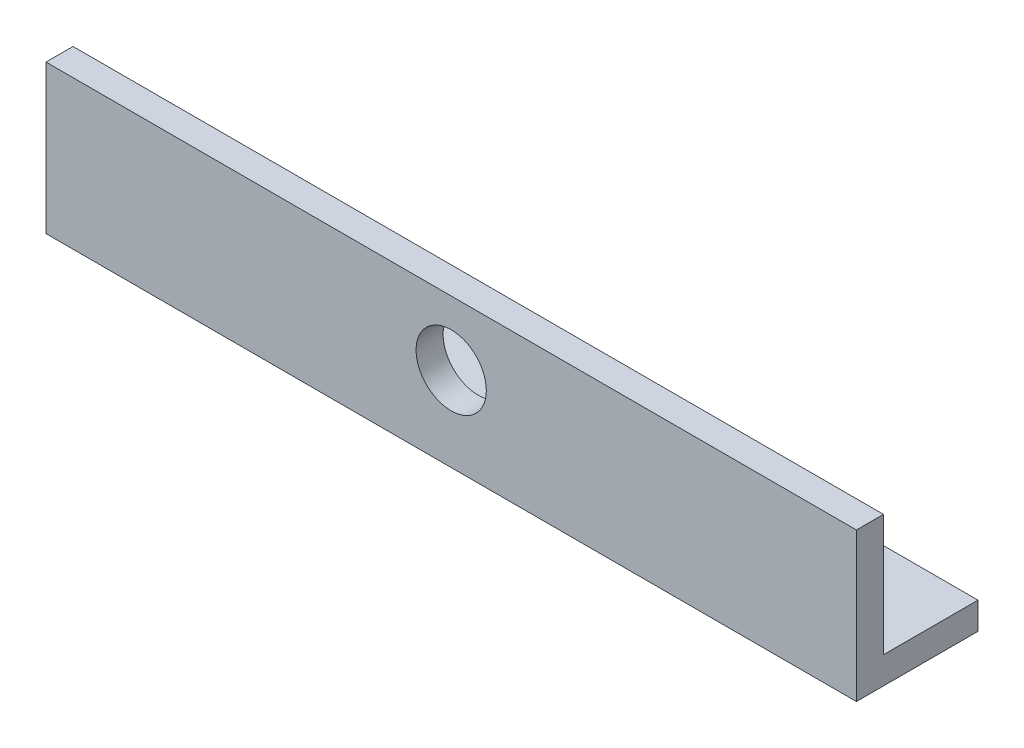
ISO-10303-21;
HEADER;
FILE_DESCRIPTION(('STEP AP214'),'2;1');
FILE_NAME('part.step','',(''),(''),'','','');
FILE_SCHEMA(('AUTOMOTIVE_DESIGN { 1 0 10303 214 1 1 1 1 }'));
ENDSEC;
DATA;
#1=APPLICATION_CONTEXT('core data for automotive mechanical design processes');
#2=APPLICATION_PROTOCOL_DEFINITION('international standard','automotive_design',2000,#1);
#3=PRODUCT_CONTEXT('',#1,'mechanical');
#4=PRODUCT('Part','Part','',(#3));
#5=PRODUCT_RELATED_PRODUCT_CATEGORY('part','',(#4));
#6=PRODUCT_DEFINITION_FORMATION('','',#4);
#7=PRODUCT_DEFINITION_CONTEXT('part definition',#1,'design');
#8=PRODUCT_DEFINITION('design','',#6,#7);
#9=PRODUCT_DEFINITION_SHAPE('','',#8);
#10=(LENGTH_UNIT() NAMED_UNIT(*) SI_UNIT(.MILLI.,.METRE.));
#11=(NAMED_UNIT(*) PLANE_ANGLE_UNIT() SI_UNIT($,.RADIAN.));
#12=(NAMED_UNIT(*) SI_UNIT($,.STERADIAN.) SOLID_ANGLE_UNIT());
#13=UNCERTAINTY_MEASURE_WITH_UNIT(LENGTH_MEASURE(1.E-05),#10,'distance_accuracy_value','');
#14=(GEOMETRIC_REPRESENTATION_CONTEXT(3) GLOBAL_UNCERTAINTY_ASSIGNED_CONTEXT((#13)) GLOBAL_UNIT_ASSIGNED_CONTEXT((#10,
#11,#12)) REPRESENTATION_CONTEXT('',''));
#15=CARTESIAN_POINT('',(0.,0.,0.));
#16=DIRECTION('',(0.,0.,1.));
#17=DIRECTION('',(1.,0.,0.));
#18=AXIS2_PLACEMENT_3D('',#15,#16,#17);
#19=CARTESIAN_POINT('',(150.,-31.1904761904762,0.));
#20=DIRECTION('',(0.,1.,0.));
#21=DIRECTION('',(0.,0.,1.));
#22=AXIS2_PLACEMENT_3D('',#19,#20,#21);
#23=PLANE('',#22);
#24=DIRECTION('',(0.,0.,-1.));
#25=VECTOR('',#24,1.);
#26=CARTESIAN_POINT('',(-150.,-31.1904761904762,0.));
#27=LINE('',#26,#25);
#28=CARTESIAN_POINT('',(-150.,-31.1904761904762,5.));
#29=VERTEX_POINT('',#28);
#30=CARTESIAN_POINT('',(-150.,-31.1904761904762,-40.));
#31=VERTEX_POINT('',#30);
#32=EDGE_CURVE('E127',#29,#31,#27,.T.);
#33=ORIENTED_EDGE('',*,*,#32,.T.);
#34=DIRECTION('',(-1.,0.,0.));
#35=VECTOR('',#34,1.);
#36=CARTESIAN_POINT('',(150.,-31.1904761904762,-40.));
#37=LINE('',#36,#35);
#38=CARTESIAN_POINT('',(150.,-31.1904761904762,-40.));
#39=VERTEX_POINT('',#38);
#40=EDGE_CURVE('E11',#39,#31,#37,.T.);
#41=ORIENTED_EDGE('',*,*,#40,.F.);
#42=DIRECTION('',(0.,0.,-1.));
#43=VECTOR('',#42,1.);
#44=CARTESIAN_POINT('',(150.,-31.1904761904762,0.));
#45=LINE('',#44,#43);
#46=CARTESIAN_POINT('',(150.,-31.1904761904762,5.));
#47=VERTEX_POINT('',#46);
#48=EDGE_CURVE('E88',#47,#39,#45,.T.);
#49=ORIENTED_EDGE('',*,*,#48,.F.);
#50=DIRECTION('',(-1.,0.,0.));
#51=VECTOR('',#50,1.);
#52=CARTESIAN_POINT('',(150.,-31.1904761904762,5.));
#53=LINE('',#52,#51);
#54=EDGE_CURVE('E123',#47,#29,#53,.T.);
#55=ORIENTED_EDGE('',*,*,#54,.T.);
#56=EDGE_LOOP('',(#33,#41,#49,#55));
#57=FACE_BOUND('',#56,.T.);
#58=ADVANCED_FACE('F41',(#57),#23,.F.);
#59=CARTESIAN_POINT('',(150.,-21.1904761904762,-40.));
#60=DIRECTION('',(0.,0.,-1.));
#61=DIRECTION('',(-1.,0.,0.));
#62=AXIS2_PLACEMENT_3D('',#59,#60,#61);
#63=PLANE('',#62);
#64=DIRECTION('',(0.,-1.,0.));
#65=VECTOR('',#64,1.);
#66=CARTESIAN_POINT('',(-150.,-21.1904761904762,-40.));
#67=LINE('',#66,#65);
#68=CARTESIAN_POINT('',(-150.,-21.1904761904762,-40.));
#69=VERTEX_POINT('',#68);
#70=EDGE_CURVE('E131',#69,#31,#67,.T.);
#71=ORIENTED_EDGE('',*,*,#70,.F.);
#72=DIRECTION('',(-1.,0.,0.));
#73=VECTOR('',#72,1.);
#74=CARTESIAN_POINT('',(150.,-21.1904761904762,-40.));
#75=LINE('',#74,#73);
#76=CARTESIAN_POINT('',(150.,-21.1904761904762,-40.));
#77=VERTEX_POINT('',#76);
#78=EDGE_CURVE('E50',#77,#69,#75,.T.);
#79=ORIENTED_EDGE('',*,*,#78,.F.);
#80=DIRECTION('',(0.,-1.,0.));
#81=VECTOR('',#80,1.);
#82=CARTESIAN_POINT('',(150.,-21.1904761904762,-40.));
#83=LINE('',#82,#81);
#84=EDGE_CURVE('E201',#77,#39,#83,.T.);
#85=ORIENTED_EDGE('',*,*,#84,.T.);
#86=ORIENTED_EDGE('',*,*,#40,.T.);
#87=EDGE_LOOP('',(#71,#79,#85,#86));
#88=FACE_BOUND('',#87,.T.);
#89=ADVANCED_FACE('F159',(#88),#63,.T.);
#90=CARTESIAN_POINT('',(150.,-21.1904761904762,0.));
#91=DIRECTION('',(0.,1.,0.));
#92=DIRECTION('',(0.,0.,1.));
#93=AXIS2_PLACEMENT_3D('',#90,#91,#92);
#94=PLANE('',#93);
#95=DIRECTION('',(0.,0.,-1.));
#96=VECTOR('',#95,1.);
#97=CARTESIAN_POINT('',(-150.,-21.1904761904762,0.));
#98=LINE('',#97,#96);
#99=CARTESIAN_POINT('',(-150.,-21.1904761904762,-5.));
#100=VERTEX_POINT('',#99);
#101=EDGE_CURVE('E136',#100,#69,#98,.T.);
#102=ORIENTED_EDGE('',*,*,#101,.F.);
#103=DIRECTION('',(-1.,0.,0.));
#104=VECTOR('',#103,1.);
#105=CARTESIAN_POINT('',(150.,-21.1904761904762,-5.));
#106=LINE('',#105,#104);
#107=CARTESIAN_POINT('',(150.,-21.1904761904762,-5.));
#108=VERTEX_POINT('',#107);
#109=EDGE_CURVE('E110',#108,#100,#106,.T.);
#110=ORIENTED_EDGE('',*,*,#109,.F.);
#111=DIRECTION('',(0.,0.,-1.));
#112=VECTOR('',#111,1.);
#113=CARTESIAN_POINT('',(150.,-21.1904761904762,0.));
#114=LINE('',#113,#112);
#115=EDGE_CURVE('E116',#108,#77,#114,.T.);
#116=ORIENTED_EDGE('',*,*,#115,.T.);
#117=ORIENTED_EDGE('',*,*,#78,.T.);
#118=EDGE_LOOP('',(#102,#110,#116,#117));
#119=FACE_BOUND('',#118,.T.);
#120=ADVANCED_FACE('F156',(#119),#94,.T.);
#121=CARTESIAN_POINT('',(150.,23.8095238095238,-5.));
#122=DIRECTION('',(0.,0.,-1.));
#123=DIRECTION('',(0.,1.,0.));
#124=AXIS2_PLACEMENT_3D('',#121,#122,#123);
#125=PLANE('',#124);
#126=CARTESIAN_POINT('',(0.,0.,-5.));
#127=DIRECTION('',(0.,0.,-1.));
#128=DIRECTION('',(0.,1.,0.));
#129=AXIS2_PLACEMENT_3D('',#126,#127,#128);
#130=CIRCLE('',#129,13.);
#131=CARTESIAN_POINT('',(0.,13.,-5.00000000000001));
#132=VERTEX_POINT('',#131);
#133=EDGE_CURVE('E132',#132,#132,#130,.T.);
#134=ORIENTED_EDGE('',*,*,#133,.F.);
#135=EDGE_LOOP('',(#134));
#136=FACE_BOUND('',#135,.T.);
#137=DIRECTION('',(0.,-1.,0.));
#138=VECTOR('',#137,1.);
#139=CARTESIAN_POINT('',(-150.,23.8095238095238,-5.));
#140=LINE('',#139,#138);
#141=CARTESIAN_POINT('',(-150.,23.8095238095238,-5.));
#142=VERTEX_POINT('',#141);
#143=EDGE_CURVE('E104',#142,#100,#140,.T.);
#144=ORIENTED_EDGE('',*,*,#143,.F.);
#145=DIRECTION('',(-1.,0.,0.));
#146=VECTOR('',#145,1.);
#147=CARTESIAN_POINT('',(150.,23.8095238095238,-5.));
#148=LINE('',#147,#146);
#149=CARTESIAN_POINT('',(150.,23.8095238095238,-5.));
#150=VERTEX_POINT('',#149);
#151=EDGE_CURVE('E99',#150,#142,#148,.T.);
#152=ORIENTED_EDGE('',*,*,#151,.F.);
#153=DIRECTION('',(0.,-1.,0.));
#154=VECTOR('',#153,1.);
#155=CARTESIAN_POINT('',(150.,23.8095238095238,-5.));
#156=LINE('',#155,#154);
#157=EDGE_CURVE('E102',#150,#108,#156,.T.);
#158=ORIENTED_EDGE('',*,*,#157,.T.);
#159=ORIENTED_EDGE('',*,*,#109,.T.);
#160=EDGE_LOOP('',(#144,#152,#158,#159));
#161=FACE_BOUND('',#160,.T.);
#162=ADVANCED_FACE('F101',(#136,#161),#125,.T.);
#163=CARTESIAN_POINT('',(150.,23.8095238095238,5.));
#164=DIRECTION('',(0.,1.,0.));
#165=DIRECTION('',(0.,0.,1.));
#166=AXIS2_PLACEMENT_3D('',#163,#164,#165);
#167=PLANE('',#166);
#168=DIRECTION('',(0.,0.,-1.));
#169=VECTOR('',#168,1.);
#170=CARTESIAN_POINT('',(-150.,23.8095238095238,5.));
#171=LINE('',#170,#169);
#172=CARTESIAN_POINT('',(-150.,23.8095238095238,5.));
#173=VERTEX_POINT('',#172);
#174=EDGE_CURVE('E142',#173,#142,#171,.T.);
#175=ORIENTED_EDGE('',*,*,#174,.F.);
#176=DIRECTION('',(-1.,0.,0.));
#177=VECTOR('',#176,1.);
#178=CARTESIAN_POINT('',(150.,23.8095238095238,5.));
#179=LINE('',#178,#177);
#180=CARTESIAN_POINT('',(150.,23.8095238095238,5.));
#181=VERTEX_POINT('',#180);
#182=EDGE_CURVE('E79',#181,#173,#179,.T.);
#183=ORIENTED_EDGE('',*,*,#182,.F.);
#184=DIRECTION('',(0.,0.,-1.));
#185=VECTOR('',#184,1.);
#186=CARTESIAN_POINT('',(150.,23.8095238095238,5.));
#187=LINE('',#186,#185);
#188=EDGE_CURVE('E114',#181,#150,#187,.T.);
#189=ORIENTED_EDGE('',*,*,#188,.T.);
#190=ORIENTED_EDGE('',*,*,#151,.T.);
#191=EDGE_LOOP('',(#175,#183,#189,#190));
#192=FACE_BOUND('',#191,.T.);
#193=ADVANCED_FACE('F119',(#192),#167,.T.);
#194=CARTESIAN_POINT('',(150.,23.8095238095238,5.));
#195=DIRECTION('',(0.,0.,-1.));
#196=DIRECTION('',(0.,1.,0.));
#197=AXIS2_PLACEMENT_3D('',#194,#195,#196);
#198=PLANE('',#197);
#199=CARTESIAN_POINT('',(0.,0.,5.));
#200=DIRECTION('',(0.,0.,1.));
#201=DIRECTION('',(1.,0.,0.));
#202=AXIS2_PLACEMENT_3D('',#199,#200,#201);
#203=CIRCLE('',#202,13.);
#204=CARTESIAN_POINT('',(13.,0.,5.));
#205=VERTEX_POINT('',#204);
#206=EDGE_CURVE('E193',#205,#205,#203,.T.);
#207=ORIENTED_EDGE('',*,*,#206,.F.);
#208=EDGE_LOOP('',(#207));
#209=FACE_BOUND('',#208,.T.);
#210=DIRECTION('',(0.,-1.,0.));
#211=VECTOR('',#210,1.);
#212=CARTESIAN_POINT('',(-150.,23.8095238095238,5.));
#213=LINE('',#212,#211);
#214=EDGE_CURVE('E82',#173,#29,#213,.T.);
#215=ORIENTED_EDGE('',*,*,#214,.T.);
#216=ORIENTED_EDGE('',*,*,#54,.F.);
#217=DIRECTION('',(0.,-1.,0.));
#218=VECTOR('',#217,1.);
#219=CARTESIAN_POINT('',(150.,23.8095238095238,5.));
#220=LINE('',#219,#218);
#221=EDGE_CURVE('E58',#181,#47,#220,.T.);
#222=ORIENTED_EDGE('',*,*,#221,.F.);
#223=ORIENTED_EDGE('',*,*,#182,.T.);
#224=EDGE_LOOP('',(#215,#216,#222,#223));
#225=FACE_BOUND('',#224,.T.);
#226=ADVANCED_FACE('F164',(#209,#225),#198,.F.);
#227=CARTESIAN_POINT('',(150.,0.,0.));
#228=DIRECTION('',(-1.,0.,0.));
#229=DIRECTION('',(0.,0.,1.));
#230=AXIS2_PLACEMENT_3D('',#227,#228,#229);
#231=PLANE('',#230);
#232=ORIENTED_EDGE('',*,*,#48,.T.);
#233=ORIENTED_EDGE('',*,*,#84,.F.);
#234=ORIENTED_EDGE('',*,*,#115,.F.);
#235=ORIENTED_EDGE('',*,*,#157,.F.);
#236=ORIENTED_EDGE('',*,*,#188,.F.);
#237=ORIENTED_EDGE('',*,*,#221,.T.);
#238=EDGE_LOOP('',(#232,#233,#234,#235,#236,#237));
#239=FACE_BOUND('',#238,.T.);
#240=ADVANCED_FACE('F113',(#239),#231,.F.);
#241=CARTESIAN_POINT('',(-150.,0.,0.));
#242=DIRECTION('',(-1.,0.,0.));
#243=DIRECTION('',(0.,0.,1.));
#244=AXIS2_PLACEMENT_3D('',#241,#242,#243);
#245=PLANE('',#244);
#246=ORIENTED_EDGE('',*,*,#32,.F.);
#247=ORIENTED_EDGE('',*,*,#214,.F.);
#248=ORIENTED_EDGE('',*,*,#174,.T.);
#249=ORIENTED_EDGE('',*,*,#143,.T.);
#250=ORIENTED_EDGE('',*,*,#101,.T.);
#251=ORIENTED_EDGE('',*,*,#70,.T.);
#252=EDGE_LOOP('',(#246,#247,#248,#249,#250,#251));
#253=FACE_BOUND('',#252,.T.);
#254=ADVANCED_FACE('F162',(#253),#245,.T.);
#255=CARTESIAN_POINT('',(0.,0.,-40.));
#256=DIRECTION('',(0.,0.,1.));
#257=DIRECTION('',(1.,0.,0.));
#258=AXIS2_PLACEMENT_3D('',#255,#256,#257);
#259=CYLINDRICAL_SURFACE('',#258,13.);
#260=ORIENTED_EDGE('',*,*,#133,.T.);
#261=EDGE_LOOP('',(#260));
#262=FACE_BOUND('',#261,.T.);
#263=ORIENTED_EDGE('',*,*,#206,.T.);
#264=EDGE_LOOP('',(#263));
#265=FACE_BOUND('',#264,.T.);
#266=ADVANCED_FACE('F205',(#262,#265),#259,.F.);
#267=CLOSED_SHELL('',(#58,#89,#120,#162,#193,#226,#240,#254,#266));
#268=MANIFOLD_SOLID_BREP('B2',#267);
#269=ADVANCED_BREP_SHAPE_REPRESENTATION('',(#18,#268),#14);
#270=SHAPE_DEFINITION_REPRESENTATION(#9,#269);
ENDSEC;
END-ISO-10303-21;
